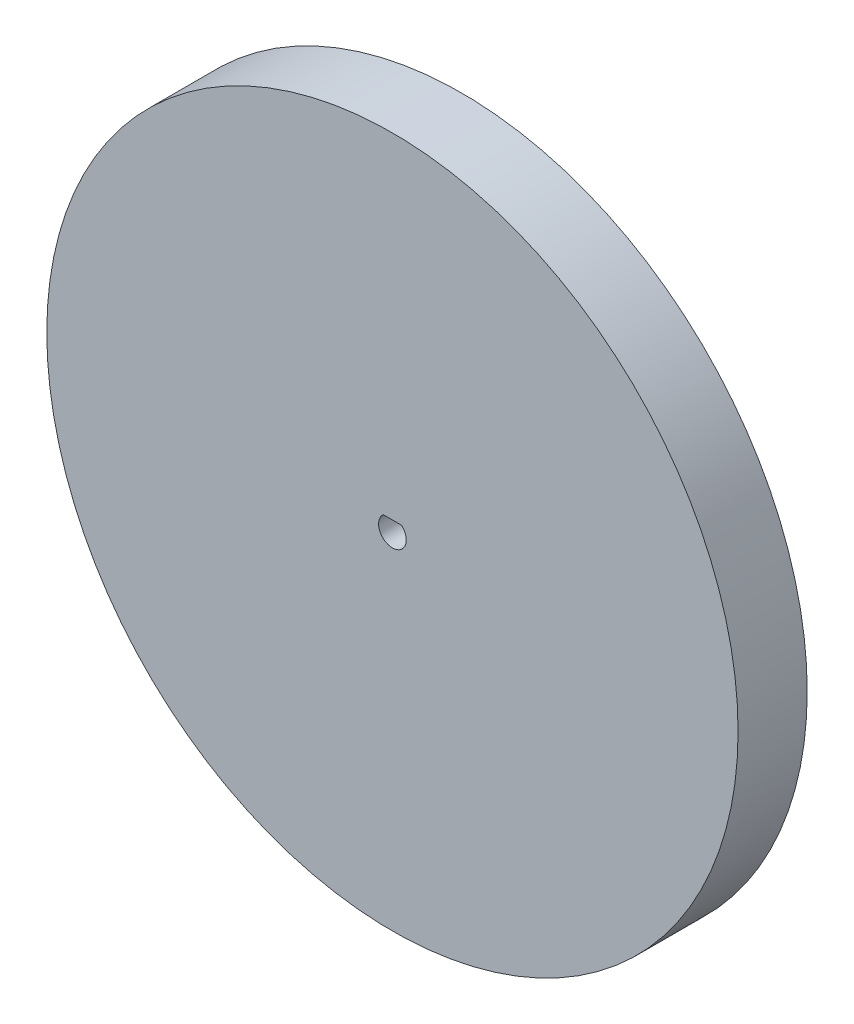
ISO-10303-21;
HEADER;
FILE_DESCRIPTION(('STEP AP214'),'2;1');
FILE_NAME('part.step','',(''),(''),'','','');
FILE_SCHEMA(('AUTOMOTIVE_DESIGN { 1 0 10303 214 1 1 1 1 }'));
ENDSEC;
DATA;
#1=APPLICATION_CONTEXT('core data for automotive mechanical design processes');
#2=APPLICATION_PROTOCOL_DEFINITION('international standard','automotive_design',2000,#1);
#3=PRODUCT_CONTEXT('',#1,'mechanical');
#4=PRODUCT('Part','Part','',(#3));
#5=PRODUCT_RELATED_PRODUCT_CATEGORY('part','',(#4));
#6=PRODUCT_DEFINITION_FORMATION('','',#4);
#7=PRODUCT_DEFINITION_CONTEXT('part definition',#1,'design');
#8=PRODUCT_DEFINITION('design','',#6,#7);
#9=PRODUCT_DEFINITION_SHAPE('','',#8);
#10=(LENGTH_UNIT() NAMED_UNIT(*) SI_UNIT(.MILLI.,.METRE.));
#11=(NAMED_UNIT(*) PLANE_ANGLE_UNIT() SI_UNIT($,.RADIAN.));
#12=(NAMED_UNIT(*) SI_UNIT($,.STERADIAN.) SOLID_ANGLE_UNIT());
#13=UNCERTAINTY_MEASURE_WITH_UNIT(LENGTH_MEASURE(1.E-05),#10,'distance_accuracy_value','');
#14=(GEOMETRIC_REPRESENTATION_CONTEXT(3) GLOBAL_UNCERTAINTY_ASSIGNED_CONTEXT((#13)) GLOBAL_UNIT_ASSIGNED_CONTEXT((#10,
#11,#12)) REPRESENTATION_CONTEXT('',''));
#15=CARTESIAN_POINT('',(0.,0.,0.));
#16=DIRECTION('',(0.,0.,1.));
#17=DIRECTION('',(1.,0.,0.));
#18=AXIS2_PLACEMENT_3D('',#15,#16,#17);
#19=CARTESIAN_POINT('',(0.,0.,10.));
#20=DIRECTION('',(0.,0.,1.));
#21=DIRECTION('',(1.,0.,0.));
#22=AXIS2_PLACEMENT_3D('',#19,#20,#21);
#23=PLANE('',#22);
#24=CARTESIAN_POINT('',(0.,0.,10.));
#25=DIRECTION('',(0.,0.,1.));
#26=DIRECTION('',(1.,0.,0.));
#27=AXIS2_PLACEMENT_3D('',#24,#25,#26);
#28=CIRCLE('',#27,50.);
#29=CARTESIAN_POINT('',(50.,0.,10.));
#30=VERTEX_POINT('',#29);
#31=EDGE_CURVE('E11',#30,#30,#28,.T.);
#32=ORIENTED_EDGE('',*,*,#31,.T.);
#33=EDGE_LOOP('',(#32));
#34=FACE_BOUND('',#33,.T.);
#35=DIRECTION('',(-1.,0.,0.));
#36=VECTOR('',#35,1.);
#37=CARTESIAN_POINT('',(-1.3228756555323,1.5,10.));
#38=LINE('',#37,#36);
#39=CARTESIAN_POINT('',(1.3228756555323,1.5,10.));
#40=VERTEX_POINT('',#39);
#41=CARTESIAN_POINT('',(-1.3228756555323,1.5,10.));
#42=VERTEX_POINT('',#41);
#43=EDGE_CURVE('E74',#40,#42,#38,.T.);
#44=ORIENTED_EDGE('',*,*,#43,.F.);
#45=CARTESIAN_POINT('',(0.,0.,10.));
#46=DIRECTION('',(0.,0.,1.));
#47=DIRECTION('',(1.,0.,0.));
#48=AXIS2_PLACEMENT_3D('',#45,#46,#47);
#49=CIRCLE('',#48,2.);
#50=EDGE_CURVE('E65',#42,#40,#49,.T.);
#51=ORIENTED_EDGE('',*,*,#50,.F.);
#52=EDGE_LOOP('',(#44,#51));
#53=FACE_BOUND('',#52,.T.);
#54=ADVANCED_FACE('F33',(#34,#53),#23,.T.);
#55=CARTESIAN_POINT('',(0.,0.,0.));
#56=DIRECTION('',(0.,0.,1.));
#57=DIRECTION('',(1.,0.,0.));
#58=AXIS2_PLACEMENT_3D('',#55,#56,#57);
#59=PLANE('',#58);
#60=CARTESIAN_POINT('',(0.,0.,0.));
#61=DIRECTION('',(0.,0.,1.));
#62=DIRECTION('',(1.,0.,0.));
#63=AXIS2_PLACEMENT_3D('',#60,#61,#62);
#64=CIRCLE('',#63,50.);
#65=CARTESIAN_POINT('',(50.,0.,0.));
#66=VERTEX_POINT('',#65);
#67=EDGE_CURVE('E37',#66,#66,#64,.T.);
#68=ORIENTED_EDGE('',*,*,#67,.F.);
#69=EDGE_LOOP('',(#68));
#70=FACE_BOUND('',#69,.T.);
#71=CARTESIAN_POINT('',(0.,0.,0.));
#72=DIRECTION('',(0.,0.,1.));
#73=DIRECTION('',(1.,0.,0.));
#74=AXIS2_PLACEMENT_3D('',#71,#72,#73);
#75=CIRCLE('',#74,2.);
#76=CARTESIAN_POINT('',(-1.3228756555323,1.5,0.));
#77=VERTEX_POINT('',#76);
#78=CARTESIAN_POINT('',(1.3228756555323,1.5,0.));
#79=VERTEX_POINT('',#78);
#80=EDGE_CURVE('E55',#77,#79,#75,.T.);
#81=ORIENTED_EDGE('',*,*,#80,.T.);
#82=DIRECTION('',(-1.,0.,0.));
#83=VECTOR('',#82,1.);
#84=CARTESIAN_POINT('',(-1.3228756555323,1.5,0.));
#85=LINE('',#84,#83);
#86=EDGE_CURVE('E61',#79,#77,#85,.T.);
#87=ORIENTED_EDGE('',*,*,#86,.T.);
#88=EDGE_LOOP('',(#81,#87));
#89=FACE_BOUND('',#88,.T.);
#90=ADVANCED_FACE('F71',(#70,#89),#59,.F.);
#91=CARTESIAN_POINT('',(0.,0.,10.));
#92=DIRECTION('',(0.,0.,-1.));
#93=DIRECTION('',(-1.,0.,0.));
#94=AXIS2_PLACEMENT_3D('',#91,#92,#93);
#95=CYLINDRICAL_SURFACE('',#94,50.);
#96=ORIENTED_EDGE('',*,*,#31,.F.);
#97=EDGE_LOOP('',(#96));
#98=FACE_BOUND('',#97,.T.);
#99=ORIENTED_EDGE('',*,*,#67,.T.);
#100=EDGE_LOOP('',(#99));
#101=FACE_BOUND('',#100,.T.);
#102=ADVANCED_FACE('F35',(#98,#101),#95,.T.);
#103=CARTESIAN_POINT('',(0.,0.,10.));
#104=DIRECTION('',(0.,0.,-1.));
#105=DIRECTION('',(-1.,0.,0.));
#106=AXIS2_PLACEMENT_3D('',#103,#104,#105);
#107=CYLINDRICAL_SURFACE('',#106,2.);
#108=ORIENTED_EDGE('',*,*,#80,.F.);
#109=DIRECTION('',(0.,0.,-1.));
#110=VECTOR('',#109,1.);
#111=CARTESIAN_POINT('',(-1.3228756555323,1.5,10.));
#112=LINE('',#111,#110);
#113=EDGE_CURVE('E63',#42,#77,#112,.T.);
#114=ORIENTED_EDGE('',*,*,#113,.F.);
#115=ORIENTED_EDGE('',*,*,#50,.T.);
#116=DIRECTION('',(0.,0.,-1.));
#117=VECTOR('',#116,1.);
#118=CARTESIAN_POINT('',(1.3228756555323,1.5,10.));
#119=LINE('',#118,#117);
#120=EDGE_CURVE('E48',#40,#79,#119,.T.);
#121=ORIENTED_EDGE('',*,*,#120,.T.);
#122=EDGE_LOOP('',(#108,#114,#115,#121));
#123=FACE_BOUND('',#122,.T.);
#124=ADVANCED_FACE('F67',(#123),#107,.F.);
#125=CARTESIAN_POINT('',(-1.3228756555323,1.5,10.));
#126=DIRECTION('',(0.,-1.,0.));
#127=DIRECTION('',(0.,0.,-1.));
#128=AXIS2_PLACEMENT_3D('',#125,#126,#127);
#129=PLANE('',#128);
#130=ORIENTED_EDGE('',*,*,#86,.F.);
#131=ORIENTED_EDGE('',*,*,#120,.F.);
#132=ORIENTED_EDGE('',*,*,#43,.T.);
#133=ORIENTED_EDGE('',*,*,#113,.T.);
#134=EDGE_LOOP('',(#130,#131,#132,#133));
#135=FACE_BOUND('',#134,.T.);
#136=ADVANCED_FACE('F62',(#135),#129,.T.);
#137=CLOSED_SHELL('',(#54,#90,#102,#124,#136));
#138=MANIFOLD_SOLID_BREP('B2',#137);
#139=ADVANCED_BREP_SHAPE_REPRESENTATION('',(#18,#138),#14);
#140=SHAPE_DEFINITION_REPRESENTATION(#9,#139);
ENDSEC;
END-ISO-10303-21;
